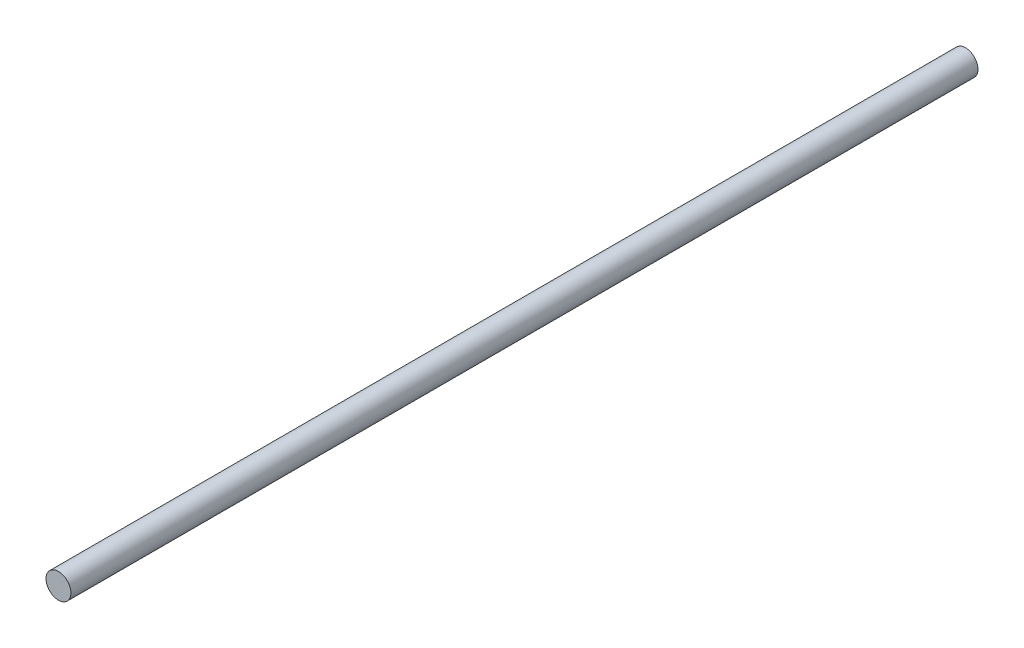
ISO-10303-21;
HEADER;
FILE_DESCRIPTION(('STEP AP214'),'2;1');
FILE_NAME('part.step','',(''),(''),'','','');
FILE_SCHEMA(('AUTOMOTIVE_DESIGN { 1 0 10303 214 1 1 1 1 }'));
ENDSEC;
DATA;
#1=APPLICATION_CONTEXT('core data for automotive mechanical design processes');
#2=APPLICATION_PROTOCOL_DEFINITION('international standard','automotive_design',2000,#1);
#3=PRODUCT_CONTEXT('',#1,'mechanical');
#4=PRODUCT('Part','Part','',(#3));
#5=PRODUCT_RELATED_PRODUCT_CATEGORY('part','',(#4));
#6=PRODUCT_DEFINITION_FORMATION('','',#4);
#7=PRODUCT_DEFINITION_CONTEXT('part definition',#1,'design');
#8=PRODUCT_DEFINITION('design','',#6,#7);
#9=PRODUCT_DEFINITION_SHAPE('','',#8);
#10=(LENGTH_UNIT() NAMED_UNIT(*) SI_UNIT(.MILLI.,.METRE.));
#11=(NAMED_UNIT(*) PLANE_ANGLE_UNIT() SI_UNIT($,.RADIAN.));
#12=(NAMED_UNIT(*) SI_UNIT($,.STERADIAN.) SOLID_ANGLE_UNIT());
#13=UNCERTAINTY_MEASURE_WITH_UNIT(LENGTH_MEASURE(1.E-05),#10,'distance_accuracy_value','');
#14=(GEOMETRIC_REPRESENTATION_CONTEXT(3) GLOBAL_UNCERTAINTY_ASSIGNED_CONTEXT((#13)) GLOBAL_UNIT_ASSIGNED_CONTEXT((#10,
#11,#12)) REPRESENTATION_CONTEXT('',''));
#15=CARTESIAN_POINT('',(0.,0.,0.));
#16=DIRECTION('',(0.,0.,1.));
#17=DIRECTION('',(1.,0.,0.));
#18=AXIS2_PLACEMENT_3D('',#15,#16,#17);
#19=CARTESIAN_POINT('',(0.,0.,152.4));
#20=DIRECTION('',(0.,0.,-1.));
#21=DIRECTION('',(-1.,0.,0.));
#22=AXIS2_PLACEMENT_3D('',#19,#20,#21);
#23=CYLINDRICAL_SURFACE('',#22,2.0955);
#24=CARTESIAN_POINT('',(0.,0.,152.4));
#25=DIRECTION('',(0.,0.,1.));
#26=DIRECTION('',(1.,0.,0.));
#27=AXIS2_PLACEMENT_3D('',#24,#25,#26);
#28=CIRCLE('',#27,2.0955);
#29=CARTESIAN_POINT('',(2.0955,0.,152.4));
#30=VERTEX_POINT('',#29);
#31=EDGE_CURVE('E10',#30,#30,#28,.T.);
#32=ORIENTED_EDGE('',*,*,#31,.F.);
#33=EDGE_LOOP('',(#32));
#34=FACE_BOUND('',#33,.T.);
#35=CARTESIAN_POINT('',(0.,0.,0.));
#36=DIRECTION('',(0.,0.,1.));
#37=DIRECTION('',(1.,0.,0.));
#38=AXIS2_PLACEMENT_3D('',#35,#36,#37);
#39=CIRCLE('',#38,2.0955);
#40=CARTESIAN_POINT('',(2.0955,0.,0.));
#41=VERTEX_POINT('',#40);
#42=EDGE_CURVE('E33',#41,#41,#39,.T.);
#43=ORIENTED_EDGE('',*,*,#42,.T.);
#44=EDGE_LOOP('',(#43));
#45=FACE_BOUND('',#44,.T.);
#46=ADVANCED_FACE('F30',(#34,#45),#23,.T.);
#47=CARTESIAN_POINT('',(0.,0.,152.4));
#48=DIRECTION('',(0.,0.,1.));
#49=DIRECTION('',(1.,0.,0.));
#50=AXIS2_PLACEMENT_3D('',#47,#48,#49);
#51=PLANE('',#50);
#52=ORIENTED_EDGE('',*,*,#31,.T.);
#53=EDGE_LOOP('',(#52));
#54=FACE_BOUND('',#53,.T.);
#55=ADVANCED_FACE('F45',(#54),#51,.T.);
#56=CARTESIAN_POINT('',(0.,0.,0.));
#57=DIRECTION('',(0.,0.,1.));
#58=DIRECTION('',(1.,0.,0.));
#59=AXIS2_PLACEMENT_3D('',#56,#57,#58);
#60=PLANE('',#59);
#61=ORIENTED_EDGE('',*,*,#42,.F.);
#62=EDGE_LOOP('',(#61));
#63=FACE_BOUND('',#62,.T.);
#64=ADVANCED_FACE('F43',(#63),#60,.F.);
#65=CLOSED_SHELL('',(#46,#55,#64));
#66=MANIFOLD_SOLID_BREP('B2',#65);
#67=ADVANCED_BREP_SHAPE_REPRESENTATION('',(#18,#66),#14);
#68=SHAPE_DEFINITION_REPRESENTATION(#9,#67);
ENDSEC;
END-ISO-10303-21;
